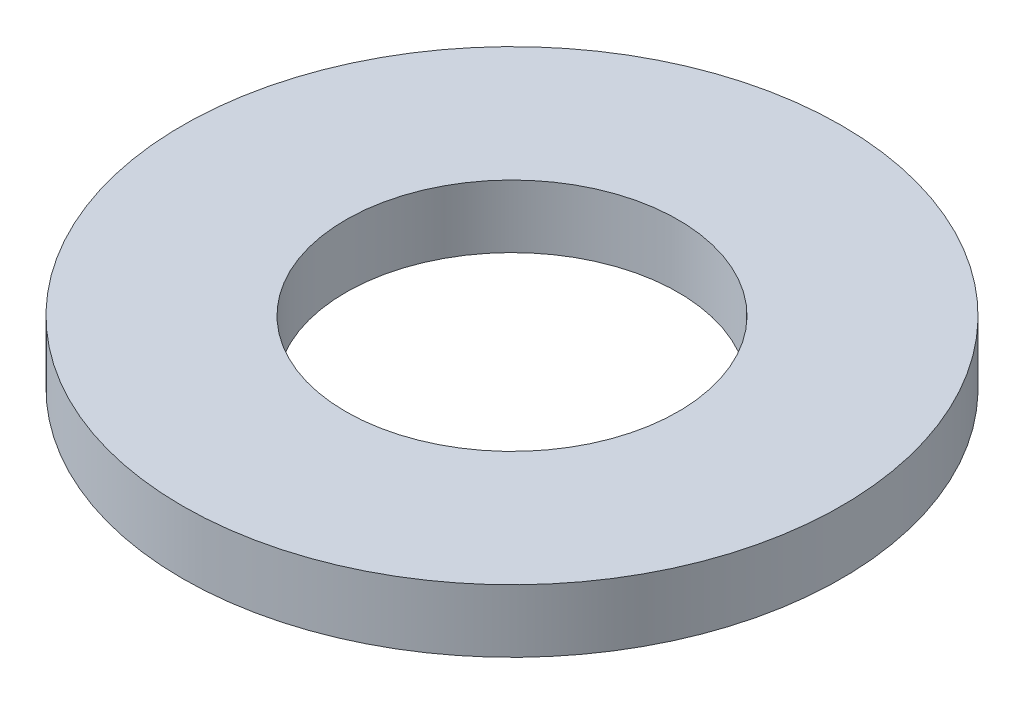
ISO-10303-21;
HEADER;
FILE_DESCRIPTION(('STEP AP214'),'2;1');
FILE_NAME('part.step','',(''),(''),'','','');
FILE_SCHEMA(('AUTOMOTIVE_DESIGN { 1 0 10303 214 1 1 1 1 }'));
ENDSEC;
DATA;
#1=APPLICATION_CONTEXT('core data for automotive mechanical design processes');
#2=APPLICATION_PROTOCOL_DEFINITION('international standard','automotive_design',2000,#1);
#3=PRODUCT_CONTEXT('',#1,'mechanical');
#4=PRODUCT('Part','Part','',(#3));
#5=PRODUCT_RELATED_PRODUCT_CATEGORY('part','',(#4));
#6=PRODUCT_DEFINITION_FORMATION('','',#4);
#7=PRODUCT_DEFINITION_CONTEXT('part definition',#1,'design');
#8=PRODUCT_DEFINITION('design','',#6,#7);
#9=PRODUCT_DEFINITION_SHAPE('','',#8);
#10=(LENGTH_UNIT() NAMED_UNIT(*) SI_UNIT(.MILLI.,.METRE.));
#11=(NAMED_UNIT(*) PLANE_ANGLE_UNIT() SI_UNIT($,.RADIAN.));
#12=(NAMED_UNIT(*) SI_UNIT($,.STERADIAN.) SOLID_ANGLE_UNIT());
#13=UNCERTAINTY_MEASURE_WITH_UNIT(LENGTH_MEASURE(1.E-05),#10,'distance_accuracy_value','');
#14=(GEOMETRIC_REPRESENTATION_CONTEXT(3) GLOBAL_UNCERTAINTY_ASSIGNED_CONTEXT((#13)) GLOBAL_UNIT_ASSIGNED_CONTEXT((#10,
#11,#12)) REPRESENTATION_CONTEXT('',''));
#15=CARTESIAN_POINT('',(0.,0.,0.));
#16=DIRECTION('',(0.,0.,1.));
#17=DIRECTION('',(1.,0.,0.));
#18=AXIS2_PLACEMENT_3D('',#15,#16,#17);
#19=CARTESIAN_POINT('',(0.,0.8382,0.));
#20=DIRECTION('',(0.,1.,0.));
#21=DIRECTION('',(0.,0.,1.));
#22=AXIS2_PLACEMENT_3D('',#19,#20,#21);
#23=PLANE('',#22);
#24=CARTESIAN_POINT('',(0.,0.8382,0.));
#25=DIRECTION('',(0.,1.,0.));
#26=DIRECTION('',(0.,0.,1.));
#27=AXIS2_PLACEMENT_3D('',#24,#25,#26);
#28=CIRCLE('',#27,8.7884);
#29=CARTESIAN_POINT('',(0.,0.8382,8.7884));
#30=VERTEX_POINT('',#29);
#31=EDGE_CURVE('E10',#30,#30,#28,.T.);
#32=ORIENTED_EDGE('',*,*,#31,.T.);
#33=EDGE_LOOP('',(#32));
#34=FACE_BOUND('',#33,.T.);
#35=CARTESIAN_POINT('',(0.,0.8382,0.));
#36=DIRECTION('',(0.,1.,0.));
#37=DIRECTION('',(0.,0.,1.));
#38=AXIS2_PLACEMENT_3D('',#35,#36,#37);
#39=CIRCLE('',#38,4.4323);
#40=CARTESIAN_POINT('',(0.,0.8382,4.4323));
#41=VERTEX_POINT('',#40);
#42=EDGE_CURVE('E39',#41,#41,#39,.T.);
#43=ORIENTED_EDGE('',*,*,#42,.F.);
#44=EDGE_LOOP('',(#43));
#45=FACE_BOUND('',#44,.T.);
#46=ADVANCED_FACE('F28',(#34,#45),#23,.T.);
#47=CARTESIAN_POINT('',(0.,-0.8382,0.));
#48=DIRECTION('',(0.,1.,0.));
#49=DIRECTION('',(0.,0.,1.));
#50=AXIS2_PLACEMENT_3D('',#47,#48,#49);
#51=PLANE('',#50);
#52=CARTESIAN_POINT('',(0.,-0.8382,0.));
#53=DIRECTION('',(0.,1.,0.));
#54=DIRECTION('',(0.,0.,1.));
#55=AXIS2_PLACEMENT_3D('',#52,#53,#54);
#56=CIRCLE('',#55,8.7884);
#57=CARTESIAN_POINT('',(0.,-0.8382,8.7884));
#58=VERTEX_POINT('',#57);
#59=EDGE_CURVE('E32',#58,#58,#56,.T.);
#60=ORIENTED_EDGE('',*,*,#59,.F.);
#61=EDGE_LOOP('',(#60));
#62=FACE_BOUND('',#61,.T.);
#63=CARTESIAN_POINT('',(0.,-0.8382,0.));
#64=DIRECTION('',(0.,1.,0.));
#65=DIRECTION('',(0.,0.,1.));
#66=AXIS2_PLACEMENT_3D('',#63,#64,#65);
#67=CIRCLE('',#66,4.4323);
#68=CARTESIAN_POINT('',(0.,-0.8382,4.4323));
#69=VERTEX_POINT('',#68);
#70=EDGE_CURVE('E41',#69,#69,#67,.T.);
#71=ORIENTED_EDGE('',*,*,#70,.T.);
#72=EDGE_LOOP('',(#71));
#73=FACE_BOUND('',#72,.T.);
#74=ADVANCED_FACE('F51',(#62,#73),#51,.F.);
#75=CARTESIAN_POINT('',(0.,0.8382,0.));
#76=DIRECTION('',(0.,-1.,0.));
#77=DIRECTION('',(0.,0.,-1.));
#78=AXIS2_PLACEMENT_3D('',#75,#76,#77);
#79=CYLINDRICAL_SURFACE('',#78,8.7884);
#80=ORIENTED_EDGE('',*,*,#31,.F.);
#81=EDGE_LOOP('',(#80));
#82=FACE_BOUND('',#81,.T.);
#83=ORIENTED_EDGE('',*,*,#59,.T.);
#84=EDGE_LOOP('',(#83));
#85=FACE_BOUND('',#84,.T.);
#86=ADVANCED_FACE('F30',(#82,#85),#79,.T.);
#87=CARTESIAN_POINT('',(0.,0.8382,0.));
#88=DIRECTION('',(0.,-1.,0.));
#89=DIRECTION('',(0.,0.,-1.));
#90=AXIS2_PLACEMENT_3D('',#87,#88,#89);
#91=CYLINDRICAL_SURFACE('',#90,4.4323);
#92=ORIENTED_EDGE('',*,*,#42,.T.);
#93=EDGE_LOOP('',(#92));
#94=FACE_BOUND('',#93,.T.);
#95=ORIENTED_EDGE('',*,*,#70,.F.);
#96=EDGE_LOOP('',(#95));
#97=FACE_BOUND('',#96,.T.);
#98=ADVANCED_FACE('F47',(#94,#97),#91,.F.);
#99=CLOSED_SHELL('',(#46,#74,#86,#98));
#100=MANIFOLD_SOLID_BREP('B2',#99);
#101=ADVANCED_BREP_SHAPE_REPRESENTATION('',(#18,#100),#14);
#102=SHAPE_DEFINITION_REPRESENTATION(#9,#101);
ENDSEC;
END-ISO-10303-21;
